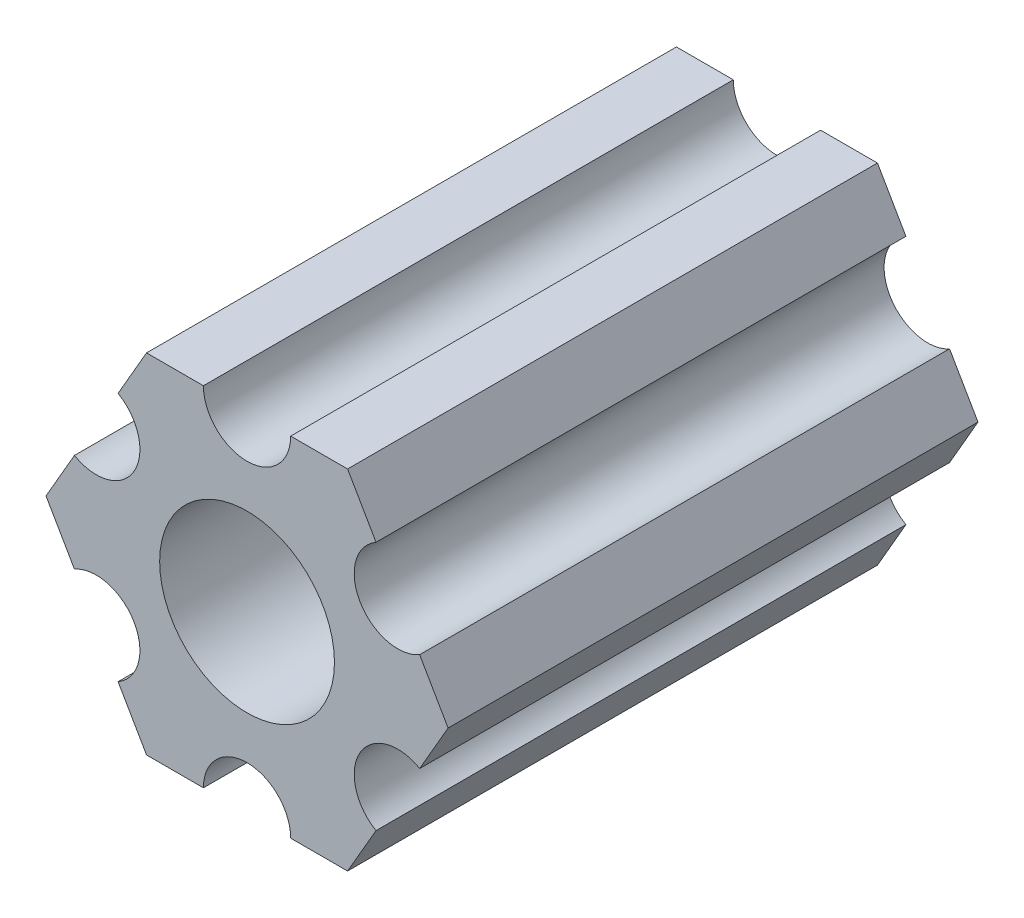
ISO-10303-21;
HEADER;
FILE_DESCRIPTION(('STEP AP214'),'2;1');
FILE_NAME('part.step','',(''),(''),'','','');
FILE_SCHEMA(('AUTOMOTIVE_DESIGN { 1 0 10303 214 1 1 1 1 }'));
ENDSEC;
DATA;
#1=APPLICATION_CONTEXT('core data for automotive mechanical design processes');
#2=APPLICATION_PROTOCOL_DEFINITION('international standard','automotive_design',2000,#1);
#3=PRODUCT_CONTEXT('',#1,'mechanical');
#4=PRODUCT('Part','Part','',(#3));
#5=PRODUCT_RELATED_PRODUCT_CATEGORY('part','',(#4));
#6=PRODUCT_DEFINITION_FORMATION('','',#4);
#7=PRODUCT_DEFINITION_CONTEXT('part definition',#1,'design');
#8=PRODUCT_DEFINITION('design','',#6,#7);
#9=PRODUCT_DEFINITION_SHAPE('','',#8);
#10=(LENGTH_UNIT() NAMED_UNIT(*) SI_UNIT(.MILLI.,.METRE.));
#11=(NAMED_UNIT(*) PLANE_ANGLE_UNIT() SI_UNIT($,.RADIAN.));
#12=(NAMED_UNIT(*) SI_UNIT($,.STERADIAN.) SOLID_ANGLE_UNIT());
#13=UNCERTAINTY_MEASURE_WITH_UNIT(LENGTH_MEASURE(1.E-05),#10,'distance_accuracy_value','');
#14=(GEOMETRIC_REPRESENTATION_CONTEXT(3) GLOBAL_UNCERTAINTY_ASSIGNED_CONTEXT((#13)) GLOBAL_UNIT_ASSIGNED_CONTEXT((#10,
#11,#12)) REPRESENTATION_CONTEXT('',''));
#15=CARTESIAN_POINT('',(0.,0.,0.));
#16=DIRECTION('',(0.,0.,1.));
#17=DIRECTION('',(1.,0.,0.));
#18=AXIS2_PLACEMENT_3D('',#15,#16,#17);
#19=CARTESIAN_POINT('',(5.49926131403118,-3.175,19.325));
#20=DIRECTION('',(0.,0.,-1.));
#21=DIRECTION('',(-1.,0.,0.));
#22=AXIS2_PLACEMENT_3D('',#19,#20,#21);
#23=CYLINDRICAL_SURFACE('',#22,1.59130995915342);
#24=CARTESIAN_POINT('',(5.49926131403118,-3.175,0.));
#25=DIRECTION('',(0.,0.,1.));
#26=DIRECTION('',(1.,0.,0.));
#27=AXIS2_PLACEMENT_3D('',#24,#25,#26);
#28=CIRCLE('',#27,1.59130995915342);
#29=CARTESIAN_POINT('',(6.2949162936079,-1.79688515007796,0.));
#30=VERTEX_POINT('',#29);
#31=CARTESIAN_POINT('',(4.70360633445448,-4.55311484992204,0.));
#32=VERTEX_POINT('',#31);
#33=EDGE_CURVE('E194',#30,#32,#28,.T.);
#34=ORIENTED_EDGE('',*,*,#33,.F.);
#35=DIRECTION('',(0.,0.,-1.));
#36=VECTOR('',#35,1.);
#37=CARTESIAN_POINT('',(6.2949162936079,-1.79688515007796,19.325));
#38=LINE('',#37,#36);
#39=CARTESIAN_POINT('',(6.2949162936079,-1.79688515007796,19.325));
#40=VERTEX_POINT('',#39);
#41=EDGE_CURVE('E12',#40,#30,#38,.T.);
#42=ORIENTED_EDGE('',*,*,#41,.F.);
#43=CARTESIAN_POINT('',(5.49926131403118,-3.175,19.325));
#44=DIRECTION('',(0.,0.,1.));
#45=DIRECTION('',(1.,0.,0.));
#46=AXIS2_PLACEMENT_3D('',#43,#44,#45);
#47=CIRCLE('',#46,1.59130995915342);
#48=CARTESIAN_POINT('',(4.70360633445448,-4.55311484992204,19.325));
#49=VERTEX_POINT('',#48);
#50=EDGE_CURVE('E245',#40,#49,#47,.T.);
#51=ORIENTED_EDGE('',*,*,#50,.T.);
#52=DIRECTION('',(0.,0.,-1.));
#53=VECTOR('',#52,1.);
#54=CARTESIAN_POINT('',(4.70360633445448,-4.55311484992204,19.325));
#55=LINE('',#54,#53);
#56=EDGE_CURVE('E122',#49,#32,#55,.T.);
#57=ORIENTED_EDGE('',*,*,#56,.T.);
#58=EDGE_LOOP('',(#34,#42,#51,#57));
#59=FACE_BOUND('',#58,.T.);
#60=ADVANCED_FACE('F35',(#59),#23,.F.);
#61=CARTESIAN_POINT('',(7.33234841870824,0.,19.325));
#62=DIRECTION('',(0.866025403784439,-0.499999999999999,0.));
#63=DIRECTION('',(0.499999999999999,0.866025403784439,0.));
#64=AXIS2_PLACEMENT_3D('',#61,#62,#63);
#65=PLANE('',#64);
#66=DIRECTION('',(-0.499999999999999,-0.866025403784439,0.));
#67=VECTOR('',#66,1.);
#68=CARTESIAN_POINT('',(7.33234841870824,0.,0.));
#69=LINE('',#68,#67);
#70=CARTESIAN_POINT('',(7.33234841870824,0.,0.));
#71=VERTEX_POINT('',#70);
#72=EDGE_CURVE('E243',#71,#30,#69,.T.);
#73=ORIENTED_EDGE('',*,*,#72,.F.);
#74=DIRECTION('',(0.,0.,-1.));
#75=VECTOR('',#74,1.);
#76=CARTESIAN_POINT('',(7.33234841870824,0.,19.325));
#77=LINE('',#76,#75);
#78=CARTESIAN_POINT('',(7.33234841870824,0.,19.325));
#79=VERTEX_POINT('',#78);
#80=EDGE_CURVE('E45',#79,#71,#77,.T.);
#81=ORIENTED_EDGE('',*,*,#80,.F.);
#82=DIRECTION('',(-0.499999999999999,-0.866025403784439,0.));
#83=VECTOR('',#82,1.);
#84=CARTESIAN_POINT('',(7.33234841870824,0.,19.325));
#85=LINE('',#84,#83);
#86=EDGE_CURVE('E184',#79,#40,#85,.T.);
#87=ORIENTED_EDGE('',*,*,#86,.T.);
#88=ORIENTED_EDGE('',*,*,#41,.T.);
#89=EDGE_LOOP('',(#73,#81,#87,#88));
#90=FACE_BOUND('',#89,.T.);
#91=ADVANCED_FACE('F358',(#90),#65,.T.);
#92=CARTESIAN_POINT('',(6.2949162936079,1.79688515007796,19.325));
#93=DIRECTION('',(0.866025403784439,0.499999999999999,0.));
#94=DIRECTION('',(-0.499999999999999,0.866025403784439,0.));
#95=AXIS2_PLACEMENT_3D('',#92,#93,#94);
#96=PLANE('',#95);
#97=DIRECTION('',(0.499999999999999,-0.866025403784439,0.));
#98=VECTOR('',#97,1.);
#99=CARTESIAN_POINT('',(6.2949162936079,1.79688515007796,0.));
#100=LINE('',#99,#98);
#101=CARTESIAN_POINT('',(6.2949162936079,1.79688515007796,0.));
#102=VERTEX_POINT('',#101);
#103=EDGE_CURVE('E171',#102,#71,#100,.T.);
#104=ORIENTED_EDGE('',*,*,#103,.F.);
#105=DIRECTION('',(0.,0.,-1.));
#106=VECTOR('',#105,1.);
#107=CARTESIAN_POINT('',(6.2949162936079,1.79688515007796,19.325));
#108=LINE('',#107,#106);
#109=CARTESIAN_POINT('',(6.2949162936079,1.79688515007796,19.325));
#110=VERTEX_POINT('',#109);
#111=EDGE_CURVE('E166',#110,#102,#108,.T.);
#112=ORIENTED_EDGE('',*,*,#111,.F.);
#113=DIRECTION('',(0.499999999999999,-0.866025403784439,0.));
#114=VECTOR('',#113,1.);
#115=CARTESIAN_POINT('',(6.2949162936079,1.79688515007796,19.325));
#116=LINE('',#115,#114);
#117=EDGE_CURVE('E169',#110,#79,#116,.T.);
#118=ORIENTED_EDGE('',*,*,#117,.T.);
#119=ORIENTED_EDGE('',*,*,#80,.T.);
#120=EDGE_LOOP('',(#104,#112,#118,#119));
#121=FACE_BOUND('',#120,.T.);
#122=ADVANCED_FACE('F168',(#121),#96,.T.);
#123=CARTESIAN_POINT('',(5.49926131403119,3.175,19.325));
#124=DIRECTION('',(0.,0.,-1.));
#125=DIRECTION('',(-1.,0.,0.));
#126=AXIS2_PLACEMENT_3D('',#123,#124,#125);
#127=CYLINDRICAL_SURFACE('',#126,1.59130995915342);
#128=CARTESIAN_POINT('',(5.49926131403119,3.175,0.));
#129=DIRECTION('',(0.,0.,1.));
#130=DIRECTION('',(1.,0.,0.));
#131=AXIS2_PLACEMENT_3D('',#128,#129,#130);
#132=CIRCLE('',#131,1.59130995915342);
#133=CARTESIAN_POINT('',(4.70360633445448,4.55311484992204,0.));
#134=VERTEX_POINT('',#133);
#135=EDGE_CURVE('E240',#134,#102,#132,.T.);
#136=ORIENTED_EDGE('',*,*,#135,.F.);
#137=DIRECTION('',(0.,0.,-1.));
#138=VECTOR('',#137,1.);
#139=CARTESIAN_POINT('',(4.70360633445448,4.55311484992204,19.325));
#140=LINE('',#139,#138);
#141=CARTESIAN_POINT('',(4.70360633445448,4.55311484992204,19.325));
#142=VERTEX_POINT('',#141);
#143=EDGE_CURVE('E176',#142,#134,#140,.T.);
#144=ORIENTED_EDGE('',*,*,#143,.F.);
#145=CARTESIAN_POINT('',(5.49926131403119,3.175,19.325));
#146=DIRECTION('',(0.,0.,1.));
#147=DIRECTION('',(1.,0.,0.));
#148=AXIS2_PLACEMENT_3D('',#145,#146,#147);
#149=CIRCLE('',#148,1.59130995915342);
#150=EDGE_CURVE('E182',#142,#110,#149,.T.);
#151=ORIENTED_EDGE('',*,*,#150,.T.);
#152=ORIENTED_EDGE('',*,*,#111,.T.);
#153=EDGE_LOOP('',(#136,#144,#151,#152));
#154=FACE_BOUND('',#153,.T.);
#155=ADVANCED_FACE('F186',(#154),#127,.F.);
#156=CARTESIAN_POINT('',(3.66617420935412,6.35,19.325));
#157=DIRECTION('',(0.866025403784438,0.5,0.));
#158=DIRECTION('',(-0.5,0.866025403784438,0.));
#159=AXIS2_PLACEMENT_3D('',#156,#157,#158);
#160=PLANE('',#159);
#161=DIRECTION('',(0.5,-0.866025403784438,0.));
#162=VECTOR('',#161,1.);
#163=CARTESIAN_POINT('',(3.66617420935412,6.35,0.));
#164=LINE('',#163,#162);
#165=CARTESIAN_POINT('',(3.66617420935412,6.35,0.));
#166=VERTEX_POINT('',#165);
#167=EDGE_CURVE('E237',#166,#134,#164,.T.);
#168=ORIENTED_EDGE('',*,*,#167,.F.);
#169=DIRECTION('',(0.,0.,-1.));
#170=VECTOR('',#169,1.);
#171=CARTESIAN_POINT('',(3.66617420935412,6.35,19.325));
#172=LINE('',#171,#170);
#173=CARTESIAN_POINT('',(3.66617420935412,6.35,19.325));
#174=VERTEX_POINT('',#173);
#175=EDGE_CURVE('E249',#174,#166,#172,.T.);
#176=ORIENTED_EDGE('',*,*,#175,.F.);
#177=DIRECTION('',(0.5,-0.866025403784438,0.));
#178=VECTOR('',#177,1.);
#179=CARTESIAN_POINT('',(3.66617420935412,6.35,19.325));
#180=LINE('',#179,#178);
#181=EDGE_CURVE('E187',#174,#142,#180,.T.);
#182=ORIENTED_EDGE('',*,*,#181,.T.);
#183=ORIENTED_EDGE('',*,*,#143,.T.);
#184=EDGE_LOOP('',(#168,#176,#182,#183));
#185=FACE_BOUND('',#184,.T.);
#186=ADVANCED_FACE('F357',(#185),#160,.T.);
#187=CARTESIAN_POINT('',(1.59130995915343,6.35,19.325));
#188=DIRECTION('',(0.,1.,0.));
#189=DIRECTION('',(0.,0.,1.));
#190=AXIS2_PLACEMENT_3D('',#187,#188,#189);
#191=PLANE('',#190);
#192=DIRECTION('',(1.,0.,0.));
#193=VECTOR('',#192,1.);
#194=CARTESIAN_POINT('',(1.59130995915343,6.35,0.));
#195=LINE('',#194,#193);
#196=CARTESIAN_POINT('',(1.59130995915343,6.35,0.));
#197=VERTEX_POINT('',#196);
#198=EDGE_CURVE('E234',#197,#166,#195,.T.);
#199=ORIENTED_EDGE('',*,*,#198,.F.);
#200=DIRECTION('',(0.,0.,-1.));
#201=VECTOR('',#200,1.);
#202=CARTESIAN_POINT('',(1.59130995915343,6.35,19.325));
#203=LINE('',#202,#201);
#204=CARTESIAN_POINT('',(1.59130995915343,6.35,19.325));
#205=VERTEX_POINT('',#204);
#206=EDGE_CURVE('E251',#205,#197,#203,.T.);
#207=ORIENTED_EDGE('',*,*,#206,.F.);
#208=DIRECTION('',(1.,0.,0.));
#209=VECTOR('',#208,1.);
#210=CARTESIAN_POINT('',(1.59130995915343,6.35,19.325));
#211=LINE('',#210,#209);
#212=EDGE_CURVE('E189',#205,#174,#211,.T.);
#213=ORIENTED_EDGE('',*,*,#212,.T.);
#214=ORIENTED_EDGE('',*,*,#175,.T.);
#215=EDGE_LOOP('',(#199,#207,#213,#214));
#216=FACE_BOUND('',#215,.T.);
#217=ADVANCED_FACE('F354',(#216),#191,.T.);
#218=CARTESIAN_POINT('',(0.,6.35,19.325));
#219=DIRECTION('',(0.,0.,-1.));
#220=DIRECTION('',(-1.,0.,0.));
#221=AXIS2_PLACEMENT_3D('',#218,#219,#220);
#222=CYLINDRICAL_SURFACE('',#221,1.59130995915342);
#223=CARTESIAN_POINT('',(0.,6.35,0.));
#224=DIRECTION('',(0.,0.,1.));
#225=DIRECTION('',(1.,0.,0.));
#226=AXIS2_PLACEMENT_3D('',#223,#224,#225);
#227=CIRCLE('',#226,1.59130995915342);
#228=CARTESIAN_POINT('',(-1.59130995915342,6.35,0.));
#229=VERTEX_POINT('',#228);
#230=EDGE_CURVE('E231',#229,#197,#227,.T.);
#231=ORIENTED_EDGE('',*,*,#230,.F.);
#232=DIRECTION('',(0.,0.,-1.));
#233=VECTOR('',#232,1.);
#234=CARTESIAN_POINT('',(-1.59130995915342,6.35,19.325));
#235=LINE('',#234,#233);
#236=CARTESIAN_POINT('',(-1.59130995915342,6.35,19.325));
#237=VERTEX_POINT('',#236);
#238=EDGE_CURVE('E253',#237,#229,#235,.T.);
#239=ORIENTED_EDGE('',*,*,#238,.F.);
#240=CARTESIAN_POINT('',(0.,6.35,19.325));
#241=DIRECTION('',(0.,0.,1.));
#242=DIRECTION('',(1.,0.,0.));
#243=AXIS2_PLACEMENT_3D('',#240,#241,#242);
#244=CIRCLE('',#243,1.59130995915342);
#245=EDGE_CURVE('E350',#237,#205,#244,.T.);
#246=ORIENTED_EDGE('',*,*,#245,.T.);
#247=ORIENTED_EDGE('',*,*,#206,.T.);
#248=EDGE_LOOP('',(#231,#239,#246,#247));
#249=FACE_BOUND('',#248,.T.);
#250=ADVANCED_FACE('F347',(#249),#222,.F.);
#251=CARTESIAN_POINT('',(-3.66617420935413,6.35,19.325));
#252=DIRECTION('',(0.,1.,0.));
#253=DIRECTION('',(0.,0.,1.));
#254=AXIS2_PLACEMENT_3D('',#251,#252,#253);
#255=PLANE('',#254);
#256=DIRECTION('',(1.,0.,0.));
#257=VECTOR('',#256,1.);
#258=CARTESIAN_POINT('',(-3.66617420935413,6.35,0.));
#259=LINE('',#258,#257);
#260=CARTESIAN_POINT('',(-3.66617420935413,6.35,0.));
#261=VERTEX_POINT('',#260);
#262=EDGE_CURVE('E228',#261,#229,#259,.T.);
#263=ORIENTED_EDGE('',*,*,#262,.F.);
#264=DIRECTION('',(0.,0.,-1.));
#265=VECTOR('',#264,1.);
#266=CARTESIAN_POINT('',(-3.66617420935413,6.35,19.325));
#267=LINE('',#266,#265);
#268=CARTESIAN_POINT('',(-3.66617420935413,6.35,19.325));
#269=VERTEX_POINT('',#268);
#270=EDGE_CURVE('E255',#269,#261,#267,.T.);
#271=ORIENTED_EDGE('',*,*,#270,.F.);
#272=DIRECTION('',(1.,0.,0.));
#273=VECTOR('',#272,1.);
#274=CARTESIAN_POINT('',(-3.66617420935413,6.35,19.325));
#275=LINE('',#274,#273);
#276=EDGE_CURVE('E524',#269,#237,#275,.T.);
#277=ORIENTED_EDGE('',*,*,#276,.T.);
#278=ORIENTED_EDGE('',*,*,#238,.T.);
#279=EDGE_LOOP('',(#263,#271,#277,#278));
#280=FACE_BOUND('',#279,.T.);
#281=ADVANCED_FACE('F343',(#280),#255,.T.);
#282=CARTESIAN_POINT('',(-4.70360633445447,4.55311484992205,19.325));
#283=DIRECTION('',(-0.866025403784439,0.5,0.));
#284=DIRECTION('',(-0.5,-0.866025403784439,0.));
#285=AXIS2_PLACEMENT_3D('',#282,#283,#284);
#286=PLANE('',#285);
#287=DIRECTION('',(0.5,0.866025403784439,0.));
#288=VECTOR('',#287,1.);
#289=CARTESIAN_POINT('',(-4.70360633445447,4.55311484992205,0.));
#290=LINE('',#289,#288);
#291=CARTESIAN_POINT('',(-4.70360633445447,4.55311484992205,0.));
#292=VERTEX_POINT('',#291);
#293=EDGE_CURVE('E225',#292,#261,#290,.T.);
#294=ORIENTED_EDGE('',*,*,#293,.F.);
#295=DIRECTION('',(0.,0.,-1.));
#296=VECTOR('',#295,1.);
#297=CARTESIAN_POINT('',(-4.70360633445447,4.55311484992205,19.325));
#298=LINE('',#297,#296);
#299=CARTESIAN_POINT('',(-4.70360633445447,4.55311484992205,19.325));
#300=VERTEX_POINT('',#299);
#301=EDGE_CURVE('E257',#300,#292,#298,.T.);
#302=ORIENTED_EDGE('',*,*,#301,.F.);
#303=DIRECTION('',(0.5,0.866025403784439,0.));
#304=VECTOR('',#303,1.);
#305=CARTESIAN_POINT('',(-4.70360633445447,4.55311484992205,19.325));
#306=LINE('',#305,#304);
#307=EDGE_CURVE('E339',#300,#269,#306,.T.);
#308=ORIENTED_EDGE('',*,*,#307,.T.);
#309=ORIENTED_EDGE('',*,*,#270,.T.);
#310=EDGE_LOOP('',(#294,#302,#308,#309));
#311=FACE_BOUND('',#310,.T.);
#312=ADVANCED_FACE('F337',(#311),#286,.T.);
#313=CARTESIAN_POINT('',(-5.49926131403118,3.175,19.325));
#314=DIRECTION('',(0.,0.,-1.));
#315=DIRECTION('',(-1.,0.,0.));
#316=AXIS2_PLACEMENT_3D('',#313,#314,#315);
#317=CYLINDRICAL_SURFACE('',#316,1.59130995915342);
#318=CARTESIAN_POINT('',(-5.49926131403118,3.175,0.));
#319=DIRECTION('',(0.,0.,1.));
#320=DIRECTION('',(1.,0.,0.));
#321=AXIS2_PLACEMENT_3D('',#318,#319,#320);
#322=CIRCLE('',#321,1.59130995915342);
#323=CARTESIAN_POINT('',(-6.29491629360789,1.79688515007796,0.));
#324=VERTEX_POINT('',#323);
#325=EDGE_CURVE('E222',#324,#292,#322,.T.);
#326=ORIENTED_EDGE('',*,*,#325,.F.);
#327=DIRECTION('',(0.,0.,-1.));
#328=VECTOR('',#327,1.);
#329=CARTESIAN_POINT('',(-6.29491629360789,1.79688515007796,19.325));
#330=LINE('',#329,#328);
#331=CARTESIAN_POINT('',(-6.29491629360789,1.79688515007796,19.325));
#332=VERTEX_POINT('',#331);
#333=EDGE_CURVE('E259',#332,#324,#330,.T.);
#334=ORIENTED_EDGE('',*,*,#333,.F.);
#335=CARTESIAN_POINT('',(-5.49926131403118,3.175,19.325));
#336=DIRECTION('',(0.,0.,1.));
#337=DIRECTION('',(1.,0.,0.));
#338=AXIS2_PLACEMENT_3D('',#335,#336,#337);
#339=CIRCLE('',#338,1.59130995915342);
#340=EDGE_CURVE('E333',#332,#300,#339,.T.);
#341=ORIENTED_EDGE('',*,*,#340,.T.);
#342=ORIENTED_EDGE('',*,*,#301,.T.);
#343=EDGE_LOOP('',(#326,#334,#341,#342));
#344=FACE_BOUND('',#343,.T.);
#345=ADVANCED_FACE('F330',(#344),#317,.F.);
#346=CARTESIAN_POINT('',(-7.33234841870825,0.,19.325));
#347=DIRECTION('',(-0.866025403784438,0.5,0.));
#348=DIRECTION('',(-0.5,-0.866025403784438,0.));
#349=AXIS2_PLACEMENT_3D('',#346,#347,#348);
#350=PLANE('',#349);
#351=DIRECTION('',(0.5,0.866025403784438,0.));
#352=VECTOR('',#351,1.);
#353=CARTESIAN_POINT('',(-7.33234841870825,0.,0.));
#354=LINE('',#353,#352);
#355=CARTESIAN_POINT('',(-7.33234841870825,0.,0.));
#356=VERTEX_POINT('',#355);
#357=EDGE_CURVE('E219',#356,#324,#354,.T.);
#358=ORIENTED_EDGE('',*,*,#357,.F.);
#359=DIRECTION('',(0.,0.,-1.));
#360=VECTOR('',#359,1.);
#361=CARTESIAN_POINT('',(-7.33234841870825,0.,19.325));
#362=LINE('',#361,#360);
#363=CARTESIAN_POINT('',(-7.33234841870825,0.,19.325));
#364=VERTEX_POINT('',#363);
#365=EDGE_CURVE('E261',#364,#356,#362,.T.);
#366=ORIENTED_EDGE('',*,*,#365,.F.);
#367=DIRECTION('',(0.5,0.866025403784438,0.));
#368=VECTOR('',#367,1.);
#369=CARTESIAN_POINT('',(-7.33234841870825,0.,19.325));
#370=LINE('',#369,#368);
#371=EDGE_CURVE('E530',#364,#332,#370,.T.);
#372=ORIENTED_EDGE('',*,*,#371,.T.);
#373=ORIENTED_EDGE('',*,*,#333,.T.);
#374=EDGE_LOOP('',(#358,#366,#372,#373));
#375=FACE_BOUND('',#374,.T.);
#376=ADVANCED_FACE('F326',(#375),#350,.T.);
#377=CARTESIAN_POINT('',(-6.2949162936079,-1.79688515007796,19.325));
#378=DIRECTION('',(-0.866025403784439,-0.5,0.));
#379=DIRECTION('',(0.5,-0.866025403784439,0.));
#380=AXIS2_PLACEMENT_3D('',#377,#378,#379);
#381=PLANE('',#380);
#382=DIRECTION('',(-0.5,0.866025403784439,0.));
#383=VECTOR('',#382,1.);
#384=CARTESIAN_POINT('',(-6.2949162936079,-1.79688515007796,0.));
#385=LINE('',#384,#383);
#386=CARTESIAN_POINT('',(-6.2949162936079,-1.79688515007796,0.));
#387=VERTEX_POINT('',#386);
#388=EDGE_CURVE('E216',#387,#356,#385,.T.);
#389=ORIENTED_EDGE('',*,*,#388,.F.);
#390=DIRECTION('',(0.,0.,-1.));
#391=VECTOR('',#390,1.);
#392=CARTESIAN_POINT('',(-6.2949162936079,-1.79688515007796,19.325));
#393=LINE('',#392,#391);
#394=CARTESIAN_POINT('',(-6.2949162936079,-1.79688515007796,19.325));
#395=VERTEX_POINT('',#394);
#396=EDGE_CURVE('E263',#395,#387,#393,.T.);
#397=ORIENTED_EDGE('',*,*,#396,.F.);
#398=DIRECTION('',(-0.5,0.866025403784439,0.));
#399=VECTOR('',#398,1.);
#400=CARTESIAN_POINT('',(-6.2949162936079,-1.79688515007796,19.325));
#401=LINE('',#400,#399);
#402=EDGE_CURVE('E322',#395,#364,#401,.T.);
#403=ORIENTED_EDGE('',*,*,#402,.T.);
#404=ORIENTED_EDGE('',*,*,#365,.T.);
#405=EDGE_LOOP('',(#389,#397,#403,#404));
#406=FACE_BOUND('',#405,.T.);
#407=ADVANCED_FACE('F320',(#406),#381,.T.);
#408=CARTESIAN_POINT('',(-5.49926131403119,-3.175,19.325));
#409=DIRECTION('',(0.,0.,-1.));
#410=DIRECTION('',(-1.,0.,0.));
#411=AXIS2_PLACEMENT_3D('',#408,#409,#410);
#412=CYLINDRICAL_SURFACE('',#411,1.59130995915342);
#413=CARTESIAN_POINT('',(-5.49926131403119,-3.175,0.));
#414=DIRECTION('',(0.,0.,1.));
#415=DIRECTION('',(1.,0.,0.));
#416=AXIS2_PLACEMENT_3D('',#413,#414,#415);
#417=CIRCLE('',#416,1.59130995915342);
#418=CARTESIAN_POINT('',(-4.70360633445448,-4.55311484992204,0.));
#419=VERTEX_POINT('',#418);
#420=EDGE_CURVE('E213',#419,#387,#417,.T.);
#421=ORIENTED_EDGE('',*,*,#420,.F.);
#422=DIRECTION('',(0.,0.,-1.));
#423=VECTOR('',#422,1.);
#424=CARTESIAN_POINT('',(-4.70360633445448,-4.55311484992204,19.325));
#425=LINE('',#424,#423);
#426=CARTESIAN_POINT('',(-4.70360633445448,-4.55311484992204,19.325));
#427=VERTEX_POINT('',#426);
#428=EDGE_CURVE('E265',#427,#419,#425,.T.);
#429=ORIENTED_EDGE('',*,*,#428,.F.);
#430=CARTESIAN_POINT('',(-5.49926131403119,-3.175,19.325));
#431=DIRECTION('',(0.,0.,1.));
#432=DIRECTION('',(1.,0.,0.));
#433=AXIS2_PLACEMENT_3D('',#430,#431,#432);
#434=CIRCLE('',#433,1.59130995915342);
#435=EDGE_CURVE('E316',#427,#395,#434,.T.);
#436=ORIENTED_EDGE('',*,*,#435,.T.);
#437=ORIENTED_EDGE('',*,*,#396,.T.);
#438=EDGE_LOOP('',(#421,#429,#436,#437));
#439=FACE_BOUND('',#438,.T.);
#440=ADVANCED_FACE('F313',(#439),#412,.F.);
#441=CARTESIAN_POINT('',(-3.66617420935412,-6.35,19.325));
#442=DIRECTION('',(-0.866025403784439,-0.5,0.));
#443=DIRECTION('',(0.5,-0.866025403784439,0.));
#444=AXIS2_PLACEMENT_3D('',#441,#442,#443);
#445=PLANE('',#444);
#446=DIRECTION('',(-0.5,0.866025403784439,0.));
#447=VECTOR('',#446,1.);
#448=CARTESIAN_POINT('',(-3.66617420935412,-6.35,0.));
#449=LINE('',#448,#447);
#450=CARTESIAN_POINT('',(-3.66617420935412,-6.35,0.));
#451=VERTEX_POINT('',#450);
#452=EDGE_CURVE('E210',#451,#419,#449,.T.);
#453=ORIENTED_EDGE('',*,*,#452,.F.);
#454=DIRECTION('',(0.,0.,-1.));
#455=VECTOR('',#454,1.);
#456=CARTESIAN_POINT('',(-3.66617420935412,-6.35,19.325));
#457=LINE('',#456,#455);
#458=CARTESIAN_POINT('',(-3.66617420935412,-6.35,19.325));
#459=VERTEX_POINT('',#458);
#460=EDGE_CURVE('E267',#459,#451,#457,.T.);
#461=ORIENTED_EDGE('',*,*,#460,.F.);
#462=DIRECTION('',(-0.5,0.866025403784439,0.));
#463=VECTOR('',#462,1.);
#464=CARTESIAN_POINT('',(-3.66617420935412,-6.35,19.325));
#465=LINE('',#464,#463);
#466=EDGE_CURVE('E534',#459,#427,#465,.T.);
#467=ORIENTED_EDGE('',*,*,#466,.T.);
#468=ORIENTED_EDGE('',*,*,#428,.T.);
#469=EDGE_LOOP('',(#453,#461,#467,#468));
#470=FACE_BOUND('',#469,.T.);
#471=ADVANCED_FACE('F309',(#470),#445,.T.);
#472=CARTESIAN_POINT('',(-1.59130995915342,-6.35,19.325));
#473=DIRECTION('',(0.,-1.,0.));
#474=DIRECTION('',(0.,0.,-1.));
#475=AXIS2_PLACEMENT_3D('',#472,#473,#474);
#476=PLANE('',#475);
#477=DIRECTION('',(-1.,0.,0.));
#478=VECTOR('',#477,1.);
#479=CARTESIAN_POINT('',(-1.59130995915342,-6.35,0.));
#480=LINE('',#479,#478);
#481=CARTESIAN_POINT('',(-1.59130995915342,-6.35,0.));
#482=VERTEX_POINT('',#481);
#483=EDGE_CURVE('E207',#482,#451,#480,.T.);
#484=ORIENTED_EDGE('',*,*,#483,.F.);
#485=DIRECTION('',(0.,0.,-1.));
#486=VECTOR('',#485,1.);
#487=CARTESIAN_POINT('',(-1.59130995915342,-6.35,19.325));
#488=LINE('',#487,#486);
#489=CARTESIAN_POINT('',(-1.59130995915342,-6.35,19.325));
#490=VERTEX_POINT('',#489);
#491=EDGE_CURVE('E269',#490,#482,#488,.T.);
#492=ORIENTED_EDGE('',*,*,#491,.F.);
#493=DIRECTION('',(-1.,0.,0.));
#494=VECTOR('',#493,1.);
#495=CARTESIAN_POINT('',(-1.59130995915342,-6.35,19.325));
#496=LINE('',#495,#494);
#497=EDGE_CURVE('E305',#490,#459,#496,.T.);
#498=ORIENTED_EDGE('',*,*,#497,.T.);
#499=ORIENTED_EDGE('',*,*,#460,.T.);
#500=EDGE_LOOP('',(#484,#492,#498,#499));
#501=FACE_BOUND('',#500,.T.);
#502=ADVANCED_FACE('F303',(#501),#476,.T.);
#503=CARTESIAN_POINT('',(0.,-6.35,19.325));
#504=DIRECTION('',(0.,0.,-1.));
#505=DIRECTION('',(-1.,0.,0.));
#506=AXIS2_PLACEMENT_3D('',#503,#504,#505);
#507=CYLINDRICAL_SURFACE('',#506,1.59130995915342);
#508=CARTESIAN_POINT('',(0.,-6.35,0.));
#509=DIRECTION('',(0.,0.,1.));
#510=DIRECTION('',(1.,0.,0.));
#511=AXIS2_PLACEMENT_3D('',#508,#509,#510);
#512=CIRCLE('',#511,1.59130995915342);
#513=CARTESIAN_POINT('',(1.59130995915342,-6.35,0.));
#514=VERTEX_POINT('',#513);
#515=EDGE_CURVE('E204',#514,#482,#512,.T.);
#516=ORIENTED_EDGE('',*,*,#515,.F.);
#517=DIRECTION('',(0.,0.,-1.));
#518=VECTOR('',#517,1.);
#519=CARTESIAN_POINT('',(1.59130995915342,-6.35,19.325));
#520=LINE('',#519,#518);
#521=CARTESIAN_POINT('',(1.59130995915342,-6.35,19.325));
#522=VERTEX_POINT('',#521);
#523=EDGE_CURVE('E271',#522,#514,#520,.T.);
#524=ORIENTED_EDGE('',*,*,#523,.F.);
#525=CARTESIAN_POINT('',(0.,-6.35,19.325));
#526=DIRECTION('',(0.,0.,1.));
#527=DIRECTION('',(1.,0.,0.));
#528=AXIS2_PLACEMENT_3D('',#525,#526,#527);
#529=CIRCLE('',#528,1.59130995915342);
#530=EDGE_CURVE('E299',#522,#490,#529,.T.);
#531=ORIENTED_EDGE('',*,*,#530,.T.);
#532=ORIENTED_EDGE('',*,*,#491,.T.);
#533=EDGE_LOOP('',(#516,#524,#531,#532));
#534=FACE_BOUND('',#533,.T.);
#535=ADVANCED_FACE('F296',(#534),#507,.F.);
#536=CARTESIAN_POINT('',(3.66617420935413,-6.35,19.325));
#537=DIRECTION('',(0.,-1.,0.));
#538=DIRECTION('',(0.,0.,-1.));
#539=AXIS2_PLACEMENT_3D('',#536,#537,#538);
#540=PLANE('',#539);
#541=DIRECTION('',(-1.,0.,0.));
#542=VECTOR('',#541,1.);
#543=CARTESIAN_POINT('',(3.66617420935413,-6.35,0.));
#544=LINE('',#543,#542);
#545=CARTESIAN_POINT('',(3.66617420935413,-6.35,0.));
#546=VERTEX_POINT('',#545);
#547=EDGE_CURVE('E201',#546,#514,#544,.T.);
#548=ORIENTED_EDGE('',*,*,#547,.F.);
#549=DIRECTION('',(0.,0.,-1.));
#550=VECTOR('',#549,1.);
#551=CARTESIAN_POINT('',(3.66617420935413,-6.35,19.325));
#552=LINE('',#551,#550);
#553=CARTESIAN_POINT('',(3.66617420935413,-6.35,19.325));
#554=VERTEX_POINT('',#553);
#555=EDGE_CURVE('E273',#554,#546,#552,.T.);
#556=ORIENTED_EDGE('',*,*,#555,.F.);
#557=DIRECTION('',(-1.,0.,0.));
#558=VECTOR('',#557,1.);
#559=CARTESIAN_POINT('',(3.66617420935413,-6.35,19.325));
#560=LINE('',#559,#558);
#561=EDGE_CURVE('E538',#554,#522,#560,.T.);
#562=ORIENTED_EDGE('',*,*,#561,.T.);
#563=ORIENTED_EDGE('',*,*,#523,.T.);
#564=EDGE_LOOP('',(#548,#556,#562,#563));
#565=FACE_BOUND('',#564,.T.);
#566=ADVANCED_FACE('F292',(#565),#540,.T.);
#567=CARTESIAN_POINT('',(4.70360633445448,-4.55311484992204,19.325));
#568=DIRECTION('',(0.866025403784438,-0.500000000000001,0.));
#569=DIRECTION('',(0.500000000000001,0.866025403784438,0.));
#570=AXIS2_PLACEMENT_3D('',#567,#568,#569);
#571=PLANE('',#570);
#572=DIRECTION('',(-0.500000000000001,-0.866025403784438,0.));
#573=VECTOR('',#572,1.);
#574=CARTESIAN_POINT('',(4.70360633445448,-4.55311484992204,0.));
#575=LINE('',#574,#573);
#576=EDGE_CURVE('E197',#32,#546,#575,.T.);
#577=ORIENTED_EDGE('',*,*,#576,.F.);
#578=ORIENTED_EDGE('',*,*,#56,.F.);
#579=DIRECTION('',(-0.500000000000001,-0.866025403784438,0.));
#580=VECTOR('',#579,1.);
#581=CARTESIAN_POINT('',(4.70360633445448,-4.55311484992204,19.325));
#582=LINE('',#581,#580);
#583=EDGE_CURVE('E288',#49,#554,#582,.T.);
#584=ORIENTED_EDGE('',*,*,#583,.T.);
#585=ORIENTED_EDGE('',*,*,#555,.T.);
#586=EDGE_LOOP('',(#577,#578,#584,#585));
#587=FACE_BOUND('',#586,.T.);
#588=ADVANCED_FACE('F286',(#587),#571,.T.);
#589=CARTESIAN_POINT('',(5.49926131403118,-3.175,19.325));
#590=DIRECTION('',(0.,0.,1.));
#591=DIRECTION('',(1.,0.,0.));
#592=AXIS2_PLACEMENT_3D('',#589,#590,#591);
#593=PLANE('',#592);
#594=CARTESIAN_POINT('',(0.,0.,19.325));
#595=DIRECTION('',(0.,0.,1.));
#596=DIRECTION('',(1.,0.,0.));
#597=AXIS2_PLACEMENT_3D('',#594,#595,#596);
#598=CIRCLE('',#597,3.1877);
#599=CARTESIAN_POINT('',(3.1877,0.,19.325));
#600=VERTEX_POINT('',#599);
#601=EDGE_CURVE('E198',#600,#600,#598,.F.);
#602=ORIENTED_EDGE('',*,*,#601,.T.);
#603=EDGE_LOOP('',(#602));
#604=FACE_BOUND('',#603,.T.);
#605=ORIENTED_EDGE('',*,*,#50,.F.);
#606=ORIENTED_EDGE('',*,*,#86,.F.);
#607=ORIENTED_EDGE('',*,*,#117,.F.);
#608=ORIENTED_EDGE('',*,*,#150,.F.);
#609=ORIENTED_EDGE('',*,*,#181,.F.);
#610=ORIENTED_EDGE('',*,*,#212,.F.);
#611=ORIENTED_EDGE('',*,*,#245,.F.);
#612=ORIENTED_EDGE('',*,*,#276,.F.);
#613=ORIENTED_EDGE('',*,*,#307,.F.);
#614=ORIENTED_EDGE('',*,*,#340,.F.);
#615=ORIENTED_EDGE('',*,*,#371,.F.);
#616=ORIENTED_EDGE('',*,*,#402,.F.);
#617=ORIENTED_EDGE('',*,*,#435,.F.);
#618=ORIENTED_EDGE('',*,*,#466,.F.);
#619=ORIENTED_EDGE('',*,*,#497,.F.);
#620=ORIENTED_EDGE('',*,*,#530,.F.);
#621=ORIENTED_EDGE('',*,*,#561,.F.);
#622=ORIENTED_EDGE('',*,*,#583,.F.);
#623=EDGE_LOOP('',(#605,#606,#607,#608,#609,#610,#611,#612,#613,#614,#615,#616,#617,#618,#619,
#620,#621,#622));
#624=FACE_BOUND('',#623,.T.);
#625=ADVANCED_FACE('F180',(#604,#624),#593,.T.);
#626=CARTESIAN_POINT('',(5.49926131403118,-3.175,0.));
#627=DIRECTION('',(0.,0.,1.));
#628=DIRECTION('',(1.,0.,0.));
#629=AXIS2_PLACEMENT_3D('',#626,#627,#628);
#630=PLANE('',#629);
#631=CARTESIAN_POINT('',(0.,0.,0.));
#632=DIRECTION('',(0.,0.,1.));
#633=DIRECTION('',(1.,0.,0.));
#634=AXIS2_PLACEMENT_3D('',#631,#632,#633);
#635=CIRCLE('',#634,3.1877);
#636=CARTESIAN_POINT('',(3.1877,0.,0.));
#637=VERTEX_POINT('',#636);
#638=EDGE_CURVE('E39',#637,#637,#635,.F.);
#639=ORIENTED_EDGE('',*,*,#638,.F.);
#640=EDGE_LOOP('',(#639));
#641=FACE_BOUND('',#640,.T.);
#642=ORIENTED_EDGE('',*,*,#33,.T.);
#643=ORIENTED_EDGE('',*,*,#576,.T.);
#644=ORIENTED_EDGE('',*,*,#547,.T.);
#645=ORIENTED_EDGE('',*,*,#515,.T.);
#646=ORIENTED_EDGE('',*,*,#483,.T.);
#647=ORIENTED_EDGE('',*,*,#452,.T.);
#648=ORIENTED_EDGE('',*,*,#420,.T.);
#649=ORIENTED_EDGE('',*,*,#388,.T.);
#650=ORIENTED_EDGE('',*,*,#357,.T.);
#651=ORIENTED_EDGE('',*,*,#325,.T.);
#652=ORIENTED_EDGE('',*,*,#293,.T.);
#653=ORIENTED_EDGE('',*,*,#262,.T.);
#654=ORIENTED_EDGE('',*,*,#230,.T.);
#655=ORIENTED_EDGE('',*,*,#198,.T.);
#656=ORIENTED_EDGE('',*,*,#167,.T.);
#657=ORIENTED_EDGE('',*,*,#135,.T.);
#658=ORIENTED_EDGE('',*,*,#103,.T.);
#659=ORIENTED_EDGE('',*,*,#72,.T.);
#660=EDGE_LOOP('',(#642,#643,#644,#645,#646,#647,#648,#649,#650,#651,#652,#653,#654,#655,#656,
#657,#658,#659));
#661=FACE_BOUND('',#660,.T.);
#662=ADVANCED_FACE('F282',(#641,#661),#630,.F.);
#663=CARTESIAN_POINT('',(0.,0.,19.325));
#664=DIRECTION('',(0.,0.,-1.));
#665=DIRECTION('',(-1.,0.,0.));
#666=AXIS2_PLACEMENT_3D('',#663,#664,#665);
#667=CYLINDRICAL_SURFACE('',#666,3.1877);
#668=ORIENTED_EDGE('',*,*,#601,.F.);
#669=EDGE_LOOP('',(#668));
#670=FACE_BOUND('',#669,.T.);
#671=ORIENTED_EDGE('',*,*,#638,.T.);
#672=EDGE_LOOP('',(#671));
#673=FACE_BOUND('',#672,.T.);
#674=ADVANCED_FACE('F37',(#670,#673),#667,.F.);
#675=CLOSED_SHELL('',(#60,#91,#122,#155,#186,#217,#250,#281,#312,#345,#376,#407,#440,#471,#502,
#535,#566,#588,#625,#662,#674));
#676=MANIFOLD_SOLID_BREP('B2',#675);
#677=ADVANCED_BREP_SHAPE_REPRESENTATION('',(#18,#676),#14);
#678=SHAPE_DEFINITION_REPRESENTATION(#9,#677);
ENDSEC;
END-ISO-10303-21;
